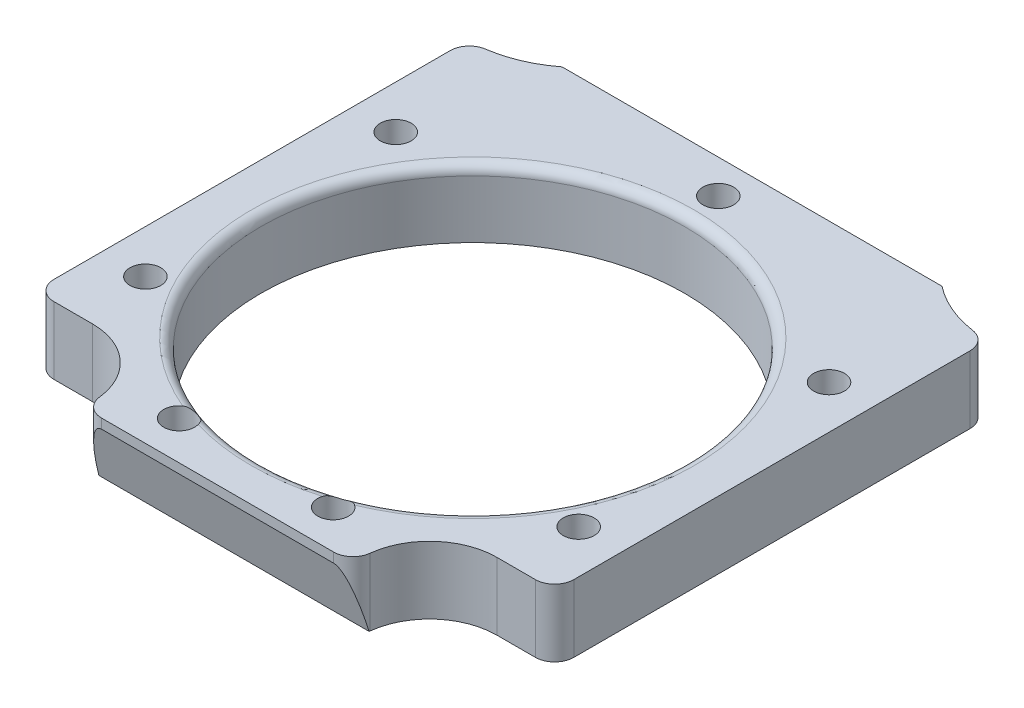
ISO-10303-21;
HEADER;
FILE_DESCRIPTION(('STEP AP214'),'2;1');
FILE_NAME('part.step','',(''),(''),'','','');
FILE_SCHEMA(('AUTOMOTIVE_DESIGN { 1 0 10303 214 1 1 1 1 }'));
ENDSEC;
DATA;
#1=APPLICATION_CONTEXT('core data for automotive mechanical design processes');
#2=APPLICATION_PROTOCOL_DEFINITION('international standard','automotive_design',2000,#1);
#3=PRODUCT_CONTEXT('',#1,'mechanical');
#4=PRODUCT('Part','Part','',(#3));
#5=PRODUCT_RELATED_PRODUCT_CATEGORY('part','',(#4));
#6=PRODUCT_DEFINITION_FORMATION('','',#4);
#7=PRODUCT_DEFINITION_CONTEXT('part definition',#1,'design');
#8=PRODUCT_DEFINITION('design','',#6,#7);
#9=PRODUCT_DEFINITION_SHAPE('','',#8);
#10=(LENGTH_UNIT() NAMED_UNIT(*) SI_UNIT(.MILLI.,.METRE.));
#11=(NAMED_UNIT(*) PLANE_ANGLE_UNIT() SI_UNIT($,.RADIAN.));
#12=(NAMED_UNIT(*) SI_UNIT($,.STERADIAN.) SOLID_ANGLE_UNIT());
#13=UNCERTAINTY_MEASURE_WITH_UNIT(LENGTH_MEASURE(1.E-05),#10,'distance_accuracy_value','');
#14=(GEOMETRIC_REPRESENTATION_CONTEXT(3) GLOBAL_UNCERTAINTY_ASSIGNED_CONTEXT((#13)) GLOBAL_UNIT_ASSIGNED_CONTEXT((#10,
#11,#12)) REPRESENTATION_CONTEXT('',''));
#15=CARTESIAN_POINT('',(0.,0.,0.));
#16=DIRECTION('',(0.,0.,1.));
#17=DIRECTION('',(1.,0.,0.));
#18=AXIS2_PLACEMENT_3D('',#15,#16,#17);
#19=CARTESIAN_POINT('',(-5.,-10.,60.));
#20=DIRECTION('',(0.,1.,0.));
#21=DIRECTION('',(0.,0.,1.));
#22=AXIS2_PLACEMENT_3D('',#19,#20,#21);
#23=CYLINDRICAL_SURFACE('',#22,7.);
#24=CARTESIAN_POINT('',(-5.,-5.,60.));
#25=DIRECTION('',(0.,1.,0.));
#26=DIRECTION('',(0.,0.,-1.));
#27=AXIS2_PLACEMENT_3D('',#24,#25,#26);
#28=CIRCLE('',#27,7.);
#29=CARTESIAN_POINT('',(1.95665592999934,-5.,59.2222222222222));
#30=VERTEX_POINT('',#29);
#31=CARTESIAN_POINT('',(-5.,-5.,53.));
#32=VERTEX_POINT('',#31);
#33=EDGE_CURVE('E338',#30,#32,#28,.T.);
#34=ORIENTED_EDGE('',*,*,#33,.T.);
#35=DIRECTION('',(0.,1.,0.));
#36=VECTOR('',#35,1.);
#37=CARTESIAN_POINT('',(-5.,-10.,53.));
#38=LINE('',#37,#36);
#39=CARTESIAN_POINT('',(-5.,-12.,53.));
#40=VERTEX_POINT('',#39);
#41=EDGE_CURVE('E228',#40,#32,#38,.T.);
#42=ORIENTED_EDGE('',*,*,#41,.F.);
#43=CARTESIAN_POINT('',(-5.,-12.,60.));
#44=DIRECTION('',(0.,1.,0.));
#45=DIRECTION('',(0.,0.,-1.));
#46=AXIS2_PLACEMENT_3D('',#43,#44,#45);
#47=CIRCLE('',#46,7.);
#48=CARTESIAN_POINT('',(1.95665592999934,-12.,59.2222222222222));
#49=VERTEX_POINT('',#48);
#50=EDGE_CURVE('E399',#49,#40,#47,.T.);
#51=ORIENTED_EDGE('',*,*,#50,.F.);
#52=DIRECTION('',(0.,1.,0.));
#53=VECTOR('',#52,1.);
#54=CARTESIAN_POINT('',(1.95665592999934,-10.,59.2222222222222));
#55=LINE('',#54,#53);
#56=EDGE_CURVE('E184',#49,#30,#55,.T.);
#57=ORIENTED_EDGE('',*,*,#56,.T.);
#58=EDGE_LOOP('',(#34,#42,#51,#57));
#59=FACE_BOUND('',#58,.T.);
#60=ADVANCED_FACE('F34',(#59),#23,.F.);
#61=CARTESIAN_POINT('',(-5.,-10.,53.));
#62=DIRECTION('',(0.,0.,-1.));
#63=DIRECTION('',(-1.,0.,0.));
#64=AXIS2_PLACEMENT_3D('',#61,#62,#63);
#65=PLANE('',#64);
#66=DIRECTION('',(-1.,0.,0.));
#67=VECTOR('',#66,1.);
#68=CARTESIAN_POINT('',(-5.,-5.,53.));
#69=LINE('',#68,#67);
#70=CARTESIAN_POINT('',(-9.,-5.,53.));
#71=VERTEX_POINT('',#70);
#72=EDGE_CURVE('E342',#32,#71,#69,.T.);
#73=ORIENTED_EDGE('',*,*,#72,.T.);
#74=DIRECTION('',(0.,1.,0.));
#75=VECTOR('',#74,1.);
#76=CARTESIAN_POINT('',(-9.,-10.,53.));
#77=LINE('',#76,#75);
#78=CARTESIAN_POINT('',(-9.,-12.,53.));
#79=VERTEX_POINT('',#78);
#80=EDGE_CURVE('E225',#79,#71,#77,.T.);
#81=ORIENTED_EDGE('',*,*,#80,.F.);
#82=DIRECTION('',(-1.,0.,0.));
#83=VECTOR('',#82,1.);
#84=CARTESIAN_POINT('',(-5.,-12.,53.));
#85=LINE('',#84,#83);
#86=EDGE_CURVE('E401',#40,#79,#85,.T.);
#87=ORIENTED_EDGE('',*,*,#86,.F.);
#88=ORIENTED_EDGE('',*,*,#41,.T.);
#89=EDGE_LOOP('',(#73,#81,#87,#88));
#90=FACE_BOUND('',#89,.T.);
#91=ADVANCED_FACE('F328',(#90),#65,.F.);
#92=CARTESIAN_POINT('',(-9.,-10.,51.));
#93=DIRECTION('',(0.,1.,0.));
#94=DIRECTION('',(0.,0.,1.));
#95=AXIS2_PLACEMENT_3D('',#92,#93,#94);
#96=CYLINDRICAL_SURFACE('',#95,2.);
#97=CARTESIAN_POINT('',(-9.,-5.,51.));
#98=DIRECTION('',(0.,-1.,0.));
#99=DIRECTION('',(0.,0.,-1.));
#100=AXIS2_PLACEMENT_3D('',#97,#98,#99);
#101=CIRCLE('',#100,2.);
#102=CARTESIAN_POINT('',(-11.,-5.,51.));
#103=VERTEX_POINT('',#102);
#104=EDGE_CURVE('E345',#71,#103,#101,.T.);
#105=ORIENTED_EDGE('',*,*,#104,.T.);
#106=DIRECTION('',(0.,1.,0.));
#107=VECTOR('',#106,1.);
#108=CARTESIAN_POINT('',(-11.,-10.,51.));
#109=LINE('',#108,#107);
#110=CARTESIAN_POINT('',(-11.,-12.,51.));
#111=VERTEX_POINT('',#110);
#112=EDGE_CURVE('E222',#111,#103,#109,.T.);
#113=ORIENTED_EDGE('',*,*,#112,.F.);
#114=CARTESIAN_POINT('',(-9.,-12.,51.));
#115=DIRECTION('',(0.,-1.,0.));
#116=DIRECTION('',(0.,0.,-1.));
#117=AXIS2_PLACEMENT_3D('',#114,#115,#116);
#118=CIRCLE('',#117,2.);
#119=EDGE_CURVE('E404',#79,#111,#118,.T.);
#120=ORIENTED_EDGE('',*,*,#119,.F.);
#121=ORIENTED_EDGE('',*,*,#80,.T.);
#122=EDGE_LOOP('',(#105,#113,#120,#121));
#123=FACE_BOUND('',#122,.T.);
#124=ADVANCED_FACE('F324',(#123),#96,.T.);
#125=CARTESIAN_POINT('',(-11.,-10.,51.));
#126=DIRECTION('',(1.,0.,0.));
#127=DIRECTION('',(0.,0.,-1.));
#128=AXIS2_PLACEMENT_3D('',#125,#126,#127);
#129=PLANE('',#128);
#130=DIRECTION('',(0.,0.,-1.));
#131=VECTOR('',#130,1.);
#132=CARTESIAN_POINT('',(-11.,-5.,51.));
#133=LINE('',#132,#131);
#134=CARTESIAN_POINT('',(-11.,-5.,9.85448097271524));
#135=VERTEX_POINT('',#134);
#136=EDGE_CURVE('E353',#103,#135,#133,.T.);
#137=ORIENTED_EDGE('',*,*,#136,.T.);
#138=DIRECTION('',(0.,1.,0.));
#139=VECTOR('',#138,1.);
#140=CARTESIAN_POINT('',(-11.,-10.,9.85448097271524));
#141=LINE('',#140,#139);
#142=CARTESIAN_POINT('',(-11.,-12.,9.85448097271524));
#143=VERTEX_POINT('',#142);
#144=EDGE_CURVE('E219',#143,#135,#141,.T.);
#145=ORIENTED_EDGE('',*,*,#144,.F.);
#146=DIRECTION('',(0.,0.,-1.));
#147=VECTOR('',#146,1.);
#148=CARTESIAN_POINT('',(-11.,-12.,51.));
#149=LINE('',#148,#147);
#150=EDGE_CURVE('E407',#111,#143,#149,.T.);
#151=ORIENTED_EDGE('',*,*,#150,.F.);
#152=ORIENTED_EDGE('',*,*,#112,.T.);
#153=EDGE_LOOP('',(#137,#145,#151,#152));
#154=FACE_BOUND('',#153,.T.);
#155=ADVANCED_FACE('F320',(#154),#129,.F.);
#156=CARTESIAN_POINT('',(-9.,-10.,9.85448097271524));
#157=DIRECTION('',(0.,1.,0.));
#158=DIRECTION('',(0.,0.,1.));
#159=AXIS2_PLACEMENT_3D('',#156,#157,#158);
#160=CYLINDRICAL_SURFACE('',#159,2.);
#161=CARTESIAN_POINT('',(-9.,-5.,9.85448097271524));
#162=DIRECTION('',(0.,-1.,0.));
#163=DIRECTION('',(0.,0.,-1.));
#164=AXIS2_PLACEMENT_3D('',#161,#162,#163);
#165=CIRCLE('',#164,2.);
#166=CARTESIAN_POINT('',(-9.28950542822678,-5.,7.87554524686985));
#167=VERTEX_POINT('',#166);
#168=EDGE_CURVE('E355',#135,#167,#165,.T.);
#169=ORIENTED_EDGE('',*,*,#168,.T.);
#170=DIRECTION('',(0.,1.,0.));
#171=VECTOR('',#170,1.);
#172=CARTESIAN_POINT('',(-9.28950542822678,-10.,7.87554524686985));
#173=LINE('',#172,#171);
#174=CARTESIAN_POINT('',(-9.28950542822678,-12.,7.87554524686985));
#175=VERTEX_POINT('',#174);
#176=EDGE_CURVE('E216',#175,#167,#173,.T.);
#177=ORIENTED_EDGE('',*,*,#176,.F.);
#178=CARTESIAN_POINT('',(-9.,-12.,9.85448097271524));
#179=DIRECTION('',(0.,-1.,0.));
#180=DIRECTION('',(0.,0.,-1.));
#181=AXIS2_PLACEMENT_3D('',#178,#179,#180);
#182=CIRCLE('',#181,2.);
#183=EDGE_CURVE('E410',#143,#175,#182,.T.);
#184=ORIENTED_EDGE('',*,*,#183,.F.);
#185=ORIENTED_EDGE('',*,*,#144,.T.);
#186=EDGE_LOOP('',(#169,#177,#184,#185));
#187=FACE_BOUND('',#186,.T.);
#188=ADVANCED_FACE('F316',(#187),#160,.T.);
#189=CARTESIAN_POINT('',(-11.,-10.,-3.81666666666667));
#190=DIRECTION('',(0.,1.,0.));
#191=DIRECTION('',(0.,0.,1.));
#192=AXIS2_PLACEMENT_3D('',#189,#190,#191);
#193=CYLINDRICAL_SURFACE('',#192,11.8166666666667);
#194=CARTESIAN_POINT('',(-11.,-5.,-3.81666666666667));
#195=DIRECTION('',(0.,1.,0.));
#196=DIRECTION('',(0.,0.,-1.));
#197=AXIS2_PLACEMENT_3D('',#194,#195,#196);
#198=CIRCLE('',#197,11.8166666666667);
#199=CARTESIAN_POINT('',(-3.73134583754782,-5.,5.49999999999999));
#200=VERTEX_POINT('',#199);
#201=EDGE_CURVE('E357',#167,#200,#198,.T.);
#202=ORIENTED_EDGE('',*,*,#201,.T.);
#203=DIRECTION('',(0.,1.,0.));
#204=VECTOR('',#203,1.);
#205=CARTESIAN_POINT('',(-3.73134583754782,-10.,5.49999999999999));
#206=LINE('',#205,#204);
#207=CARTESIAN_POINT('',(-3.73134583754782,-12.,5.49999999999999));
#208=VERTEX_POINT('',#207);
#209=EDGE_CURVE('E213',#208,#200,#206,.T.);
#210=ORIENTED_EDGE('',*,*,#209,.F.);
#211=CARTESIAN_POINT('',(-11.,-12.,-3.81666666666667));
#212=DIRECTION('',(0.,1.,0.));
#213=DIRECTION('',(0.,0.,-1.));
#214=AXIS2_PLACEMENT_3D('',#211,#212,#213);
#215=CIRCLE('',#214,11.8166666666667);
#216=EDGE_CURVE('E454',#175,#208,#215,.T.);
#217=ORIENTED_EDGE('',*,*,#216,.F.);
#218=ORIENTED_EDGE('',*,*,#176,.T.);
#219=EDGE_LOOP('',(#202,#210,#217,#218));
#220=FACE_BOUND('',#219,.T.);
#221=ADVANCED_FACE('F312',(#220),#193,.F.);
#222=CARTESIAN_POINT('',(-3.73134583754782,-10.,5.49999999999999));
#223=DIRECTION('',(0.,0.,1.));
#224=DIRECTION('',(1.,0.,0.));
#225=AXIS2_PLACEMENT_3D('',#222,#223,#224);
#226=PLANE('',#225);
#227=DIRECTION('',(1.,0.,0.));
#228=VECTOR('',#227,1.);
#229=CARTESIAN_POINT('',(-3.73134583754782,-5.,5.49999999999999));
#230=LINE('',#229,#228);
#231=CARTESIAN_POINT('',(35.7313458375478,-5.,5.5));
#232=VERTEX_POINT('',#231);
#233=EDGE_CURVE('E359',#200,#232,#230,.T.);
#234=ORIENTED_EDGE('',*,*,#233,.T.);
#235=DIRECTION('',(0.,1.,0.));
#236=VECTOR('',#235,1.);
#237=CARTESIAN_POINT('',(35.7313458375478,-10.,5.5));
#238=LINE('',#237,#236);
#239=CARTESIAN_POINT('',(35.7313458375478,-12.,5.5));
#240=VERTEX_POINT('',#239);
#241=EDGE_CURVE('E210',#240,#232,#238,.T.);
#242=ORIENTED_EDGE('',*,*,#241,.F.);
#243=DIRECTION('',(1.,0.,0.));
#244=VECTOR('',#243,1.);
#245=CARTESIAN_POINT('',(-3.73134583754782,-12.,5.49999999999999));
#246=LINE('',#245,#244);
#247=EDGE_CURVE('E457',#208,#240,#246,.T.);
#248=ORIENTED_EDGE('',*,*,#247,.F.);
#249=ORIENTED_EDGE('',*,*,#209,.T.);
#250=EDGE_LOOP('',(#234,#242,#248,#249));
#251=FACE_BOUND('',#250,.T.);
#252=ADVANCED_FACE('F308',(#251),#226,.F.);
#253=CARTESIAN_POINT('',(43.,-10.,-3.81666666666666));
#254=DIRECTION('',(0.,1.,0.));
#255=DIRECTION('',(0.,0.,1.));
#256=AXIS2_PLACEMENT_3D('',#253,#254,#255);
#257=CYLINDRICAL_SURFACE('',#256,11.8166666666667);
#258=CARTESIAN_POINT('',(43.,-5.,-3.81666666666666));
#259=DIRECTION('',(0.,1.,0.));
#260=DIRECTION('',(0.,0.,-1.));
#261=AXIS2_PLACEMENT_3D('',#258,#259,#260);
#262=CIRCLE('',#261,11.8166666666667);
#263=CARTESIAN_POINT('',(41.2895054282268,-5.,7.87554524686987));
#264=VERTEX_POINT('',#263);
#265=EDGE_CURVE('E361',#232,#264,#262,.T.);
#266=ORIENTED_EDGE('',*,*,#265,.T.);
#267=DIRECTION('',(0.,1.,0.));
#268=VECTOR('',#267,1.);
#269=CARTESIAN_POINT('',(41.2895054282268,-10.,7.87554524686987));
#270=LINE('',#269,#268);
#271=CARTESIAN_POINT('',(41.2895054282268,-12.,7.87554524686987));
#272=VERTEX_POINT('',#271);
#273=EDGE_CURVE('E207',#272,#264,#270,.T.);
#274=ORIENTED_EDGE('',*,*,#273,.F.);
#275=CARTESIAN_POINT('',(43.,-12.,-3.81666666666666));
#276=DIRECTION('',(0.,1.,0.));
#277=DIRECTION('',(0.,0.,-1.));
#278=AXIS2_PLACEMENT_3D('',#275,#276,#277);
#279=CIRCLE('',#278,11.8166666666667);
#280=EDGE_CURVE('E460',#240,#272,#279,.T.);
#281=ORIENTED_EDGE('',*,*,#280,.F.);
#282=ORIENTED_EDGE('',*,*,#241,.T.);
#283=EDGE_LOOP('',(#266,#274,#281,#282));
#284=FACE_BOUND('',#283,.T.);
#285=ADVANCED_FACE('F304',(#284),#257,.F.);
#286=CARTESIAN_POINT('',(41.,-10.,9.85448097271526));
#287=DIRECTION('',(0.,1.,0.));
#288=DIRECTION('',(0.,0.,1.));
#289=AXIS2_PLACEMENT_3D('',#286,#287,#288);
#290=CYLINDRICAL_SURFACE('',#289,2.);
#291=CARTESIAN_POINT('',(41.,-5.,9.85448097271526));
#292=DIRECTION('',(0.,-1.,0.));
#293=DIRECTION('',(0.,0.,-1.));
#294=AXIS2_PLACEMENT_3D('',#291,#292,#293);
#295=CIRCLE('',#294,2.);
#296=CARTESIAN_POINT('',(43.,-5.,9.85448097271528));
#297=VERTEX_POINT('',#296);
#298=EDGE_CURVE('E363',#264,#297,#295,.T.);
#299=ORIENTED_EDGE('',*,*,#298,.T.);
#300=DIRECTION('',(0.,1.,0.));
#301=VECTOR('',#300,1.);
#302=CARTESIAN_POINT('',(43.,-10.,9.85448097271528));
#303=LINE('',#302,#301);
#304=CARTESIAN_POINT('',(43.,-12.,9.85448097271528));
#305=VERTEX_POINT('',#304);
#306=EDGE_CURVE('E204',#305,#297,#303,.T.);
#307=ORIENTED_EDGE('',*,*,#306,.F.);
#308=CARTESIAN_POINT('',(41.,-12.,9.85448097271526));
#309=DIRECTION('',(0.,-1.,0.));
#310=DIRECTION('',(0.,0.,-1.));
#311=AXIS2_PLACEMENT_3D('',#308,#309,#310);
#312=CIRCLE('',#311,2.);
#313=EDGE_CURVE('E463',#272,#305,#312,.T.);
#314=ORIENTED_EDGE('',*,*,#313,.F.);
#315=ORIENTED_EDGE('',*,*,#273,.T.);
#316=EDGE_LOOP('',(#299,#307,#314,#315));
#317=FACE_BOUND('',#316,.T.);
#318=ADVANCED_FACE('F300',(#317),#290,.T.);
#319=CARTESIAN_POINT('',(43.,-10.,9.85448097271528));
#320=DIRECTION('',(-1.,0.,0.));
#321=DIRECTION('',(0.,0.,1.));
#322=AXIS2_PLACEMENT_3D('',#319,#320,#321);
#323=PLANE('',#322);
#324=DIRECTION('',(0.,0.,1.));
#325=VECTOR('',#324,1.);
#326=CARTESIAN_POINT('',(43.,-5.,9.85448097271528));
#327=LINE('',#326,#325);
#328=CARTESIAN_POINT('',(43.,-5.,51.));
#329=VERTEX_POINT('',#328);
#330=EDGE_CURVE('E365',#297,#329,#327,.T.);
#331=ORIENTED_EDGE('',*,*,#330,.T.);
#332=DIRECTION('',(0.,1.,0.));
#333=VECTOR('',#332,1.);
#334=CARTESIAN_POINT('',(43.,-10.,51.));
#335=LINE('',#334,#333);
#336=CARTESIAN_POINT('',(43.,-12.,51.));
#337=VERTEX_POINT('',#336);
#338=EDGE_CURVE('E201',#337,#329,#335,.T.);
#339=ORIENTED_EDGE('',*,*,#338,.F.);
#340=DIRECTION('',(0.,0.,1.));
#341=VECTOR('',#340,1.);
#342=CARTESIAN_POINT('',(43.,-12.,9.85448097271528));
#343=LINE('',#342,#341);
#344=EDGE_CURVE('E466',#305,#337,#343,.T.);
#345=ORIENTED_EDGE('',*,*,#344,.F.);
#346=ORIENTED_EDGE('',*,*,#306,.T.);
#347=EDGE_LOOP('',(#331,#339,#345,#346));
#348=FACE_BOUND('',#347,.T.);
#349=ADVANCED_FACE('F296',(#348),#323,.F.);
#350=CARTESIAN_POINT('',(41.,-10.,51.));
#351=DIRECTION('',(0.,1.,0.));
#352=DIRECTION('',(0.,0.,1.));
#353=AXIS2_PLACEMENT_3D('',#350,#351,#352);
#354=CYLINDRICAL_SURFACE('',#353,2.);
#355=CARTESIAN_POINT('',(41.,-5.,51.));
#356=DIRECTION('',(0.,-1.,0.));
#357=DIRECTION('',(0.,0.,-1.));
#358=AXIS2_PLACEMENT_3D('',#355,#356,#357);
#359=CIRCLE('',#358,2.);
#360=CARTESIAN_POINT('',(41.,-5.,53.));
#361=VERTEX_POINT('',#360);
#362=EDGE_CURVE('E367',#329,#361,#359,.T.);
#363=ORIENTED_EDGE('',*,*,#362,.T.);
#364=DIRECTION('',(0.,1.,0.));
#365=VECTOR('',#364,1.);
#366=CARTESIAN_POINT('',(41.,-10.,53.));
#367=LINE('',#366,#365);
#368=CARTESIAN_POINT('',(41.,-12.,53.));
#369=VERTEX_POINT('',#368);
#370=EDGE_CURVE('E198',#369,#361,#367,.T.);
#371=ORIENTED_EDGE('',*,*,#370,.F.);
#372=CARTESIAN_POINT('',(41.,-12.,51.));
#373=DIRECTION('',(0.,-1.,0.));
#374=DIRECTION('',(0.,0.,-1.));
#375=AXIS2_PLACEMENT_3D('',#372,#373,#374);
#376=CIRCLE('',#375,2.);
#377=EDGE_CURVE('E394',#337,#369,#376,.T.);
#378=ORIENTED_EDGE('',*,*,#377,.F.);
#379=ORIENTED_EDGE('',*,*,#338,.T.);
#380=EDGE_LOOP('',(#363,#371,#378,#379));
#381=FACE_BOUND('',#380,.T.);
#382=ADVANCED_FACE('F292',(#381),#354,.T.);
#383=CARTESIAN_POINT('',(41.,-10.,53.));
#384=DIRECTION('',(0.,0.,-1.));
#385=DIRECTION('',(-1.,0.,0.));
#386=AXIS2_PLACEMENT_3D('',#383,#384,#385);
#387=PLANE('',#386);
#388=DIRECTION('',(-1.,0.,0.));
#389=VECTOR('',#388,1.);
#390=CARTESIAN_POINT('',(41.,-5.,53.));
#391=LINE('',#390,#389);
#392=CARTESIAN_POINT('',(37.,-5.,53.));
#393=VERTEX_POINT('',#392);
#394=EDGE_CURVE('E369',#361,#393,#391,.T.);
#395=ORIENTED_EDGE('',*,*,#394,.T.);
#396=DIRECTION('',(0.,1.,0.));
#397=VECTOR('',#396,1.);
#398=CARTESIAN_POINT('',(37.,-10.,53.));
#399=LINE('',#398,#397);
#400=CARTESIAN_POINT('',(37.,-12.,53.));
#401=VERTEX_POINT('',#400);
#402=EDGE_CURVE('E195',#401,#393,#399,.T.);
#403=ORIENTED_EDGE('',*,*,#402,.F.);
#404=DIRECTION('',(-1.,0.,0.));
#405=VECTOR('',#404,1.);
#406=CARTESIAN_POINT('',(41.,-12.,53.));
#407=LINE('',#406,#405);
#408=EDGE_CURVE('E391',#369,#401,#407,.T.);
#409=ORIENTED_EDGE('',*,*,#408,.F.);
#410=ORIENTED_EDGE('',*,*,#370,.T.);
#411=EDGE_LOOP('',(#395,#403,#409,#410));
#412=FACE_BOUND('',#411,.T.);
#413=ADVANCED_FACE('F288',(#412),#387,.F.);
#414=CARTESIAN_POINT('',(37.,-10.,60.));
#415=DIRECTION('',(0.,1.,0.));
#416=DIRECTION('',(0.,0.,1.));
#417=AXIS2_PLACEMENT_3D('',#414,#415,#416);
#418=CYLINDRICAL_SURFACE('',#417,7.);
#419=CARTESIAN_POINT('',(37.,-5.,60.));
#420=DIRECTION('',(0.,1.,0.));
#421=DIRECTION('',(0.,0.,-1.));
#422=AXIS2_PLACEMENT_3D('',#419,#420,#421);
#423=CIRCLE('',#422,7.);
#424=CARTESIAN_POINT('',(30.0433440700007,-5.,59.2222222222222));
#425=VERTEX_POINT('',#424);
#426=EDGE_CURVE('E371',#393,#425,#423,.T.);
#427=ORIENTED_EDGE('',*,*,#426,.T.);
#428=DIRECTION('',(0.,1.,0.));
#429=VECTOR('',#428,1.);
#430=CARTESIAN_POINT('',(30.0433440700007,-10.,59.2222222222222));
#431=LINE('',#430,#429);
#432=CARTESIAN_POINT('',(30.0433440700007,-12.,59.2222222222222));
#433=VERTEX_POINT('',#432);
#434=EDGE_CURVE('E186',#433,#425,#431,.T.);
#435=ORIENTED_EDGE('',*,*,#434,.F.);
#436=CARTESIAN_POINT('',(37.,-12.,60.));
#437=DIRECTION('',(0.,1.,0.));
#438=DIRECTION('',(0.,0.,-1.));
#439=AXIS2_PLACEMENT_3D('',#436,#437,#438);
#440=CIRCLE('',#439,7.);
#441=EDGE_CURVE('E384',#401,#433,#440,.T.);
#442=ORIENTED_EDGE('',*,*,#441,.F.);
#443=ORIENTED_EDGE('',*,*,#402,.T.);
#444=EDGE_LOOP('',(#427,#435,#442,#443));
#445=FACE_BOUND('',#444,.T.);
#446=ADVANCED_FACE('F284',(#445),#418,.F.);
#447=CARTESIAN_POINT('',(28.0557280900008,-10.,59.));
#448=DIRECTION('',(0.,1.,0.));
#449=DIRECTION('',(0.,0.,1.));
#450=AXIS2_PLACEMENT_3D('',#447,#448,#449);
#451=CYLINDRICAL_SURFACE('',#450,2.);
#452=DIRECTION('',(0.,1.,0.));
#453=VECTOR('',#452,1.);
#454=CARTESIAN_POINT('',(28.0557280900008,-10.,61.));
#455=LINE('',#454,#453);
#456=CARTESIAN_POINT('',(28.0557280900009,-6.,61.));
#457=VERTEX_POINT('',#456);
#458=CARTESIAN_POINT('',(28.0557280900008,-5.,61.));
#459=VERTEX_POINT('',#458);
#460=EDGE_CURVE('E183',#457,#459,#455,.T.);
#461=ORIENTED_EDGE('',*,*,#460,.F.);
#462=CARTESIAN_POINT('',(28.0557280900008,-13.0588235294118,59.));
#463=DIRECTION('',(0.,0.272602572456025,-0.962126726315384));
#464=DIRECTION('',(0.,0.962126726315384,0.272602572456025));
#465=AXIS2_PLACEMENT_3D('',#462,#463,#464);
#466=ELLIPSE('',#465,7.336687918903,2.);
#467=CARTESIAN_POINT('',(30.0331000833294,-12.,59.3));
#468=VERTEX_POINT('',#467);
#469=EDGE_CURVE('E166',#457,#468,#466,.T.);
#470=ORIENTED_EDGE('',*,*,#469,.T.);
#471=CARTESIAN_POINT('',(28.0557280900008,-12.,59.));
#472=DIRECTION('',(0.,-1.,0.));
#473=DIRECTION('',(0.,0.,-1.));
#474=AXIS2_PLACEMENT_3D('',#471,#472,#473);
#475=CIRCLE('',#474,2.);
#476=EDGE_CURVE('E381',#433,#468,#475,.T.);
#477=ORIENTED_EDGE('',*,*,#476,.F.);
#478=ORIENTED_EDGE('',*,*,#434,.T.);
#479=CARTESIAN_POINT('',(28.0557280900008,-5.,59.));
#480=DIRECTION('',(0.,-1.,0.));
#481=DIRECTION('',(0.,0.,-1.));
#482=AXIS2_PLACEMENT_3D('',#479,#480,#481);
#483=CIRCLE('',#482,2.);
#484=EDGE_CURVE('E373',#425,#459,#483,.T.);
#485=ORIENTED_EDGE('',*,*,#484,.T.);
#486=EDGE_LOOP('',(#461,#470,#477,#478,#485));
#487=FACE_BOUND('',#486,.T.);
#488=ADVANCED_FACE('F281',(#487),#451,.T.);
#489=CARTESIAN_POINT('',(28.0557280900008,-10.,61.));
#490=DIRECTION('',(0.,0.,-1.));
#491=DIRECTION('',(-1.,0.,0.));
#492=AXIS2_PLACEMENT_3D('',#489,#490,#491);
#493=PLANE('',#492);
#494=DIRECTION('',(0.,1.,0.));
#495=VECTOR('',#494,1.);
#496=CARTESIAN_POINT('',(3.94427190999916,-10.,61.));
#497=LINE('',#496,#495);
#498=CARTESIAN_POINT('',(3.94427190999916,-6.,61.));
#499=VERTEX_POINT('',#498);
#500=CARTESIAN_POINT('',(3.94427190999916,-5.,61.));
#501=VERTEX_POINT('',#500);
#502=EDGE_CURVE('E174',#499,#501,#497,.T.);
#503=ORIENTED_EDGE('',*,*,#502,.F.);
#504=DIRECTION('',(1.,0.,0.));
#505=VECTOR('',#504,1.);
#506=CARTESIAN_POINT('',(-11.,-6.,61.));
#507=LINE('',#506,#505);
#508=EDGE_CURVE('E163',#499,#457,#507,.T.);
#509=ORIENTED_EDGE('',*,*,#508,.T.);
#510=ORIENTED_EDGE('',*,*,#460,.T.);
#511=DIRECTION('',(-1.,0.,0.));
#512=VECTOR('',#511,1.);
#513=CARTESIAN_POINT('',(28.0557280900008,-5.,61.));
#514=LINE('',#513,#512);
#515=EDGE_CURVE('E181',#459,#501,#514,.T.);
#516=ORIENTED_EDGE('',*,*,#515,.T.);
#517=EDGE_LOOP('',(#503,#509,#510,#516));
#518=FACE_BOUND('',#517,.T.);
#519=ADVANCED_FACE('F179',(#518),#493,.F.);
#520=CARTESIAN_POINT('',(3.94427190999916,-10.,59.));
#521=DIRECTION('',(0.,1.,0.));
#522=DIRECTION('',(0.,0.,1.));
#523=AXIS2_PLACEMENT_3D('',#520,#521,#522);
#524=CYLINDRICAL_SURFACE('',#523,2.);
#525=CARTESIAN_POINT('',(3.94427190999916,-12.,59.));
#526=DIRECTION('',(0.,-1.,0.));
#527=DIRECTION('',(0.,0.,-1.));
#528=AXIS2_PLACEMENT_3D('',#525,#526,#527);
#529=CIRCLE('',#528,2.);
#530=CARTESIAN_POINT('',(1.96689991667064,-12.,59.3));
#531=VERTEX_POINT('',#530);
#532=EDGE_CURVE('E177',#531,#49,#529,.T.);
#533=ORIENTED_EDGE('',*,*,#532,.F.);
#534=CARTESIAN_POINT('',(3.94427190999916,-13.0588235294118,59.));
#535=DIRECTION('',(0.,0.272602572456025,-0.962126726315384));
#536=DIRECTION('',(0.,0.962126726315384,0.272602572456025));
#537=AXIS2_PLACEMENT_3D('',#534,#535,#536);
#538=ELLIPSE('',#537,7.336687918903,2.);
#539=EDGE_CURVE('E49',#531,#499,#538,.T.);
#540=ORIENTED_EDGE('',*,*,#539,.T.);
#541=ORIENTED_EDGE('',*,*,#502,.T.);
#542=CARTESIAN_POINT('',(3.94427190999916,-5.,59.));
#543=DIRECTION('',(0.,-1.,0.));
#544=DIRECTION('',(0.,0.,-1.));
#545=AXIS2_PLACEMENT_3D('',#542,#543,#544);
#546=CIRCLE('',#545,2.);
#547=EDGE_CURVE('E189',#501,#30,#546,.T.);
#548=ORIENTED_EDGE('',*,*,#547,.T.);
#549=ORIENTED_EDGE('',*,*,#56,.F.);
#550=EDGE_LOOP('',(#533,#540,#541,#548,#549));
#551=FACE_BOUND('',#550,.T.);
#552=ADVANCED_FACE('F173',(#551),#524,.T.);
#553=CARTESIAN_POINT('',(-5.,-5.,60.));
#554=DIRECTION('',(0.,-1.,0.));
#555=DIRECTION('',(0.,0.,-1.));
#556=AXIS2_PLACEMENT_3D('',#553,#554,#555);
#557=PLANE('',#556);
#558=CARTESIAN_POINT('',(16.,-5.,9.00000000000001));
#559=DIRECTION('',(0.,-1.,0.));
#560=DIRECTION('',(0.,0.,-1.));
#561=AXIS2_PLACEMENT_3D('',#558,#559,#560);
#562=CIRCLE('',#561,1.6);
#563=CARTESIAN_POINT('',(16.,-5.,7.4));
#564=VERTEX_POINT('',#563);
#565=EDGE_CURVE('E413',#564,#564,#562,.T.);
#566=ORIENTED_EDGE('',*,*,#565,.T.);
#567=EDGE_LOOP('',(#566));
#568=FACE_BOUND('',#567,.T.);
#569=CARTESIAN_POINT('',(8.,-5.,57.));
#570=DIRECTION('',(0.,-1.,0.));
#571=DIRECTION('',(0.,0.,-1.));
#572=AXIS2_PLACEMENT_3D('',#569,#570,#571);
#573=CIRCLE('',#572,1.6);
#574=CARTESIAN_POINT('',(9.54249076188678,-5.,56.5748856042264));
#575=VERTEX_POINT('',#574);
#576=CARTESIAN_POINT('',(7.07211686634647,-5.,55.6965304413676));
#577=VERTEX_POINT('',#576);
#578=EDGE_CURVE('E416',#575,#577,#573,.T.);
#579=ORIENTED_EDGE('',*,*,#578,.T.);
#580=CARTESIAN_POINT('',(16.,-5.,34.5));
#581=DIRECTION('',(0.,-1.,0.));
#582=DIRECTION('',(0.,0.,-1.));
#583=AXIS2_PLACEMENT_3D('',#580,#581,#582);
#584=CIRCLE('',#583,23.);
#585=CARTESIAN_POINT('',(24.9278831336535,-5.,55.6965304413676));
#586=VERTEX_POINT('',#585);
#587=EDGE_CURVE('E233',#577,#586,#584,.T.);
#588=ORIENTED_EDGE('',*,*,#587,.T.);
#589=CARTESIAN_POINT('',(24.,-5.,57.));
#590=DIRECTION('',(0.,-1.,0.));
#591=DIRECTION('',(0.,0.,-1.));
#592=AXIS2_PLACEMENT_3D('',#589,#590,#591);
#593=CIRCLE('',#592,1.6);
#594=CARTESIAN_POINT('',(22.4575092381132,-5.,56.5748856042264));
#595=VERTEX_POINT('',#594);
#596=EDGE_CURVE('E419',#586,#595,#593,.T.);
#597=ORIENTED_EDGE('',*,*,#596,.T.);
#598=CARTESIAN_POINT('',(16.,-5.,34.5));
#599=DIRECTION('',(0.,-1.,0.));
#600=DIRECTION('',(0.,0.,-1.));
#601=AXIS2_PLACEMENT_3D('',#598,#599,#600);
#602=CIRCLE('',#601,23.);
#603=EDGE_CURVE('E231',#595,#575,#602,.T.);
#604=ORIENTED_EDGE('',*,*,#603,.T.);
#605=EDGE_LOOP('',(#579,#588,#597,#604));
#606=FACE_BOUND('',#605,.T.);
#607=CARTESIAN_POINT('',(38.5,-5.,46.));
#608=DIRECTION('',(0.,-1.,0.));
#609=DIRECTION('',(0.,0.,-1.));
#610=AXIS2_PLACEMENT_3D('',#607,#608,#609);
#611=CIRCLE('',#610,1.6);
#612=CARTESIAN_POINT('',(38.5,-5.,44.4));
#613=VERTEX_POINT('',#612);
#614=EDGE_CURVE('E421',#613,#613,#611,.T.);
#615=ORIENTED_EDGE('',*,*,#614,.T.);
#616=EDGE_LOOP('',(#615));
#617=FACE_BOUND('',#616,.T.);
#618=CARTESIAN_POINT('',(-6.5,-5.,46.));
#619=DIRECTION('',(0.,-1.,0.));
#620=DIRECTION('',(0.,0.,-1.));
#621=AXIS2_PLACEMENT_3D('',#618,#619,#620);
#622=CIRCLE('',#621,1.59999999999999);
#623=CARTESIAN_POINT('',(-6.5,-5.,44.4));
#624=VERTEX_POINT('',#623);
#625=EDGE_CURVE('E424',#624,#624,#622,.T.);
#626=ORIENTED_EDGE('',*,*,#625,.T.);
#627=EDGE_LOOP('',(#626));
#628=FACE_BOUND('',#627,.T.);
#629=CARTESIAN_POINT('',(-6.5,-5.,20.));
#630=DIRECTION('',(0.,-1.,0.));
#631=DIRECTION('',(0.,0.,-1.));
#632=AXIS2_PLACEMENT_3D('',#629,#630,#631);
#633=CIRCLE('',#632,1.6);
#634=CARTESIAN_POINT('',(-6.5,-5.,18.4));
#635=VERTEX_POINT('',#634);
#636=EDGE_CURVE('E348',#635,#635,#633,.T.);
#637=ORIENTED_EDGE('',*,*,#636,.T.);
#638=EDGE_LOOP('',(#637));
#639=FACE_BOUND('',#638,.T.);
#640=CARTESIAN_POINT('',(38.5,-5.,20.));
#641=DIRECTION('',(0.,-1.,0.));
#642=DIRECTION('',(0.,0.,-1.));
#643=AXIS2_PLACEMENT_3D('',#640,#641,#642);
#644=CIRCLE('',#643,1.6);
#645=CARTESIAN_POINT('',(38.5,-5.,18.4));
#646=VERTEX_POINT('',#645);
#647=EDGE_CURVE('E343',#646,#646,#644,.T.);
#648=ORIENTED_EDGE('',*,*,#647,.T.);
#649=EDGE_LOOP('',(#648));
#650=FACE_BOUND('',#649,.T.);
#651=ORIENTED_EDGE('',*,*,#33,.F.);
#652=ORIENTED_EDGE('',*,*,#547,.F.);
#653=ORIENTED_EDGE('',*,*,#515,.F.);
#654=ORIENTED_EDGE('',*,*,#484,.F.);
#655=ORIENTED_EDGE('',*,*,#426,.F.);
#656=ORIENTED_EDGE('',*,*,#394,.F.);
#657=ORIENTED_EDGE('',*,*,#362,.F.);
#658=ORIENTED_EDGE('',*,*,#330,.F.);
#659=ORIENTED_EDGE('',*,*,#298,.F.);
#660=ORIENTED_EDGE('',*,*,#265,.F.);
#661=ORIENTED_EDGE('',*,*,#233,.F.);
#662=ORIENTED_EDGE('',*,*,#201,.F.);
#663=ORIENTED_EDGE('',*,*,#168,.F.);
#664=ORIENTED_EDGE('',*,*,#136,.F.);
#665=ORIENTED_EDGE('',*,*,#104,.F.);
#666=ORIENTED_EDGE('',*,*,#72,.F.);
#667=EDGE_LOOP('',(#651,#652,#653,#654,#655,#656,#657,#658,#659,#660,#661,#662,#663,#664,#665,#666));
#668=FACE_BOUND('',#667,.T.);
#669=ADVANCED_FACE('F272',(#568,#606,#617,#628,#639,#650,#668),#557,.F.);
#670=CARTESIAN_POINT('',(16.,-5.,34.5));
#671=DIRECTION('',(0.,-1.,0.));
#672=DIRECTION('',(0.,0.,-1.));
#673=AXIS2_PLACEMENT_3D('',#670,#671,#672);
#674=CYLINDRICAL_SURFACE('',#673,22.);
#675=CARTESIAN_POINT('',(16.,-6.,34.5));
#676=DIRECTION('',(0.,-1.,0.));
#677=DIRECTION('',(0.,0.,-1.));
#678=AXIS2_PLACEMENT_3D('',#675,#676,#677);
#679=CIRCLE('',#678,22.);
#680=CARTESIAN_POINT('',(16.,-6.,12.5));
#681=VERTEX_POINT('',#680);
#682=EDGE_CURVE('E43',#681,#681,#679,.F.);
#683=ORIENTED_EDGE('',*,*,#682,.T.);
#684=EDGE_LOOP('',(#683));
#685=FACE_BOUND('',#684,.T.);
#686=CARTESIAN_POINT('',(16.,-12.,34.5));
#687=DIRECTION('',(0.,-1.,0.));
#688=DIRECTION('',(0.,0.,-1.));
#689=AXIS2_PLACEMENT_3D('',#686,#687,#688);
#690=CIRCLE('',#689,22.);
#691=CARTESIAN_POINT('',(16.,-12.,12.5));
#692=VERTEX_POINT('',#691);
#693=EDGE_CURVE('E487',#692,#692,#690,.T.);
#694=ORIENTED_EDGE('',*,*,#693,.T.);
#695=EDGE_LOOP('',(#694));
#696=FACE_BOUND('',#695,.T.);
#697=ADVANCED_FACE('F268',(#685,#696),#674,.F.);
#698=CARTESIAN_POINT('',(38.5,-5.,20.));
#699=DIRECTION('',(0.,-1.,0.));
#700=DIRECTION('',(0.,0.,-1.));
#701=AXIS2_PLACEMENT_3D('',#698,#699,#700);
#702=CYLINDRICAL_SURFACE('',#701,1.6);
#703=ORIENTED_EDGE('',*,*,#647,.F.);
#704=EDGE_LOOP('',(#703));
#705=FACE_BOUND('',#704,.T.);
#706=CARTESIAN_POINT('',(38.5,-12.,20.));
#707=DIRECTION('',(0.,-1.,0.));
#708=DIRECTION('',(0.,0.,-1.));
#709=AXIS2_PLACEMENT_3D('',#706,#707,#708);
#710=CIRCLE('',#709,1.6);
#711=CARTESIAN_POINT('',(38.5,-12.,18.4));
#712=VERTEX_POINT('',#711);
#713=EDGE_CURVE('E435',#712,#712,#710,.T.);
#714=ORIENTED_EDGE('',*,*,#713,.T.);
#715=EDGE_LOOP('',(#714));
#716=FACE_BOUND('',#715,.T.);
#717=ADVANCED_FACE('F264',(#705,#716),#702,.F.);
#718=CARTESIAN_POINT('',(-6.5,-5.,20.));
#719=DIRECTION('',(0.,-1.,0.));
#720=DIRECTION('',(0.,0.,-1.));
#721=AXIS2_PLACEMENT_3D('',#718,#719,#720);
#722=CYLINDRICAL_SURFACE('',#721,1.6);
#723=ORIENTED_EDGE('',*,*,#636,.F.);
#724=EDGE_LOOP('',(#723));
#725=FACE_BOUND('',#724,.T.);
#726=CARTESIAN_POINT('',(-6.5,-12.,20.));
#727=DIRECTION('',(0.,-1.,0.));
#728=DIRECTION('',(0.,0.,-1.));
#729=AXIS2_PLACEMENT_3D('',#726,#727,#728);
#730=CIRCLE('',#729,1.6);
#731=CARTESIAN_POINT('',(-6.5,-12.,18.4));
#732=VERTEX_POINT('',#731);
#733=EDGE_CURVE('E433',#732,#732,#730,.T.);
#734=ORIENTED_EDGE('',*,*,#733,.T.);
#735=EDGE_LOOP('',(#734));
#736=FACE_BOUND('',#735,.T.);
#737=ADVANCED_FACE('F260',(#725,#736),#722,.F.);
#738=CARTESIAN_POINT('',(-6.5,-5.,46.));
#739=DIRECTION('',(0.,-1.,0.));
#740=DIRECTION('',(0.,0.,-1.));
#741=AXIS2_PLACEMENT_3D('',#738,#739,#740);
#742=CYLINDRICAL_SURFACE('',#741,1.59999999999999);
#743=ORIENTED_EDGE('',*,*,#625,.F.);
#744=EDGE_LOOP('',(#743));
#745=FACE_BOUND('',#744,.T.);
#746=CARTESIAN_POINT('',(-6.5,-12.,46.));
#747=DIRECTION('',(0.,-1.,0.));
#748=DIRECTION('',(0.,0.,-1.));
#749=AXIS2_PLACEMENT_3D('',#746,#747,#748);
#750=CIRCLE('',#749,1.59999999999999);
#751=CARTESIAN_POINT('',(-6.5,-12.,44.4));
#752=VERTEX_POINT('',#751);
#753=EDGE_CURVE('E436',#752,#752,#750,.T.);
#754=ORIENTED_EDGE('',*,*,#753,.T.);
#755=EDGE_LOOP('',(#754));
#756=FACE_BOUND('',#755,.T.);
#757=ADVANCED_FACE('F256',(#745,#756),#742,.F.);
#758=CARTESIAN_POINT('',(38.5,-5.,46.));
#759=DIRECTION('',(0.,-1.,0.));
#760=DIRECTION('',(0.,0.,-1.));
#761=AXIS2_PLACEMENT_3D('',#758,#759,#760);
#762=CYLINDRICAL_SURFACE('',#761,1.6);
#763=ORIENTED_EDGE('',*,*,#614,.F.);
#764=EDGE_LOOP('',(#763));
#765=FACE_BOUND('',#764,.T.);
#766=CARTESIAN_POINT('',(38.5,-12.,46.));
#767=DIRECTION('',(0.,-1.,0.));
#768=DIRECTION('',(0.,0.,-1.));
#769=AXIS2_PLACEMENT_3D('',#766,#767,#768);
#770=CIRCLE('',#769,1.6);
#771=CARTESIAN_POINT('',(38.5,-12.,44.4));
#772=VERTEX_POINT('',#771);
#773=EDGE_CURVE('E448',#772,#772,#770,.T.);
#774=ORIENTED_EDGE('',*,*,#773,.T.);
#775=EDGE_LOOP('',(#774));
#776=FACE_BOUND('',#775,.T.);
#777=ADVANCED_FACE('F251',(#765,#776),#762,.F.);
#778=CARTESIAN_POINT('',(24.,-5.,57.));
#779=DIRECTION('',(0.,-1.,0.));
#780=DIRECTION('',(0.,0.,-1.));
#781=AXIS2_PLACEMENT_3D('',#778,#779,#780);
#782=CYLINDRICAL_SURFACE('',#781,1.6);
#783=ORIENTED_EDGE('',*,*,#596,.F.);
#784=CARTESIAN_POINT('',(24.9278831336535,-5.,55.6965304413676));
#785=CARTESIAN_POINT('',(24.8985595586239,-4.99999916298257,55.6756495852396));
#786=CARTESIAN_POINT('',(24.8685585951859,-5.00140627967512,55.6557914407111));
#787=CARTESIAN_POINT('',(24.8075025524096,-5.00664543457321,55.6182556891589));
#788=CARTESIAN_POINT('',(24.7764496754766,-5.01047267080839,55.6005738467524));
#789=CARTESIAN_POINT('',(24.6826260943259,-5.02491105366178,55.5512145377805));
#790=CARTESIAN_POINT('',(24.6185837044822,-5.03849503488442,55.5227949206222));
#791=CARTESIAN_POINT('',(24.4687487862134,-5.07562063169612,55.4675262390698));
#792=CARTESIAN_POINT('',(24.3822782099163,-5.10093550205885,55.4437979635193));
#793=CARTESIAN_POINT('',(24.206978483967,-5.15424385021034,55.4109235326586));
#794=CARTESIAN_POINT('',(24.1181394691739,-5.18225047102885,55.401853224894));
#795=CARTESIAN_POINT('',(23.9585111419398,-5.22845259836079,55.3990050833753));
#796=CARTESIAN_POINT('',(23.8880091573117,-5.24745592054002,55.4023244502546));
#797=CARTESIAN_POINT('',(23.7468238221568,-5.27882226293274,55.4185792090326));
#798=CARTESIAN_POINT('',(23.6761434915796,-5.29122048232235,55.4314627340598));
#799=CARTESIAN_POINT('',(23.5707377221875,-5.30222673232844,55.4582217344557));
#800=CARTESIAN_POINT('',(23.5354597088705,-5.30461969104205,55.4684791227803));
#801=CARTESIAN_POINT('',(23.4656181713576,-5.30658654178749,55.4914296616354));
#802=CARTESIAN_POINT('',(23.431054588409,-5.30616066656456,55.5041226109828));
#803=CARTESIAN_POINT('',(23.3629538722735,-5.30251977427189,55.5318287364844));
#804=CARTESIAN_POINT('',(23.3294187107156,-5.29929970898891,55.5468460716952));
#805=CARTESIAN_POINT('',(23.2637149406072,-5.2903709765539,55.5790058667908));
#806=CARTESIAN_POINT('',(23.2315473034796,-5.28466057176398,55.596149804528));
#807=CARTESIAN_POINT('',(23.1276259944778,-5.26239886056287,55.6561346211445));
#808=CARTESIAN_POINT('',(23.059231390776,-5.24144687965047,55.7032118069989));
#809=CARTESIAN_POINT('',(22.9312276469607,-5.19513863322594,55.8064578023954));
#810=CARTESIAN_POINT('',(22.8716537137377,-5.16976555369506,55.8626612626835));
#811=CARTESIAN_POINT('',(22.7589849379539,-5.11891304658427,55.9864923619498));
#812=CARTESIAN_POINT('',(22.7063092929026,-5.09348150619506,56.0545240103173));
#813=CARTESIAN_POINT('',(22.6120231625273,-5.04926873593281,56.199434752896));
#814=CARTESIAN_POINT('',(22.5703443153537,-5.03044616687419,56.2762547150956));
#815=CARTESIAN_POINT('',(22.5195995748642,-5.01211633237173,56.3918189104083));
#816=CARTESIAN_POINT('',(22.5054057097386,-5.00770366956671,56.4275752387293));
#817=CARTESIAN_POINT('',(22.4795164907979,-5.00163973044508,56.5003678968644));
#818=CARTESIAN_POINT('',(22.4678315564809,-4.99999978258573,56.5374088498234));
#819=CARTESIAN_POINT('',(22.4575092381132,-5.,56.5748856042264));
#820=B_SPLINE_CURVE_WITH_KNOTS('',3,(#784,#785,#786,#787,#788,#789,#790,#791,#792,#793,#794,
#795,#796,#797,#798,#799,#800,#801,#802,#803,#804,#805,#806,#807,#808,#809,#810,#811,#812,#813,
#814,#815,#816,#817,#818,#819),.UNSPECIFIED.,.F.,.F.,(4,2,2,2,2,2,2,2,2,2,2,2,2,2,2,2,2,4),(0.,
0.107881522043801,0.215549655755381,0.428690437755951,0.706817006681653,0.98637818395702,
1.20499262445801,1.42243009072709,1.53270696988103,1.64297474381636,1.75344215233144,
1.8639867632684,2.11937916653092,2.37576494984417,2.64383924129275,2.91020553335893,
3.02619608942619,3.14265941200959),.UNSPECIFIED.);
#821=EDGE_CURVE('E56',#586,#595,#820,.T.);
#822=ORIENTED_EDGE('',*,*,#821,.T.);
#823=EDGE_LOOP('',(#783,#822));
#824=FACE_BOUND('',#823,.T.);
#825=CARTESIAN_POINT('',(24.,-12.,57.));
#826=DIRECTION('',(0.,-1.,0.));
#827=DIRECTION('',(0.,0.,-1.));
#828=AXIS2_PLACEMENT_3D('',#825,#826,#827);
#829=CIRCLE('',#828,1.6);
#830=CARTESIAN_POINT('',(24.,-12.,55.4));
#831=VERTEX_POINT('',#830);
#832=EDGE_CURVE('E439',#831,#831,#829,.T.);
#833=ORIENTED_EDGE('',*,*,#832,.T.);
#834=EDGE_LOOP('',(#833));
#835=FACE_BOUND('',#834,.T.);
#836=ADVANCED_FACE('F246',(#824,#835),#782,.F.);
#837=CARTESIAN_POINT('',(8.,-5.,57.));
#838=DIRECTION('',(0.,-1.,0.));
#839=DIRECTION('',(0.,0.,-1.));
#840=AXIS2_PLACEMENT_3D('',#837,#838,#839);
#841=CYLINDRICAL_SURFACE('',#840,1.6);
#842=ORIENTED_EDGE('',*,*,#578,.F.);
#843=CARTESIAN_POINT('',(9.54249076188678,-5.,56.5748856042264));
#844=CARTESIAN_POINT('',(9.5329313706535,-4.99999916298257,56.5401796934271));
#845=CARTESIAN_POINT('',(9.52220099967551,-5.00140627967511,56.5058392966618));
#846=CARTESIAN_POINT('',(9.49854617396921,-5.00664543457321,56.4381841252047));
#847=CARTESIAN_POINT('',(9.48562610109364,-5.01047267080839,56.4048674561996));
#848=CARTESIAN_POINT('',(9.44402307166097,-5.02491105366178,56.3073564634647));
#849=CARTESIAN_POINT('',(9.41229718874747,-5.03849503488442,56.2448859048817));
#850=CARTESIAN_POINT('',(9.3309858915173,-5.07562063169612,56.107431902263));
#851=CARTESIAN_POINT('',(9.2789044655301,-5.10093550205885,56.0344406925669));
#852=CARTESIAN_POINT('',(9.16370672999097,-5.15424385021034,55.8982782753992));
#853=CARTESIAN_POINT('',(9.10053488694487,-5.18225047102884,55.8351596626252));
#854=CARTESIAN_POINT('',(8.97853524332795,-5.22845259836078,55.7321771314705));
#855=CARTESIAN_POINT('',(8.92176281934143,-5.24745592054001,55.6902433752868));
#856=CARTESIAN_POINT('',(8.80200669898659,-5.27882226293274,55.6137189498836));
#857=CARTESIAN_POINT('',(8.73905808836396,-5.29122048232236,55.5790899624842));
#858=CARTESIAN_POINT('',(8.64041899734039,-5.30222673232845,55.5332996791767));
#859=CARTESIAN_POINT('',(8.60658408074895,-5.30461969104205,55.5189835813116));
#860=CARTESIAN_POINT('',(8.53793065864821,-5.30658654178748,55.4926914678597));
#861=CARTESIAN_POINT('',(8.50311223458147,-5.30616066656456,55.4807152591572));
#862=CARTESIAN_POINT('',(8.43280667229913,-5.30251977427189,55.4592102634436));
#863=CARTESIAN_POINT('',(8.39731843753394,-5.29929970898891,55.4496859466283));
#864=CARTESIAN_POINT('',(8.32606018489934,-5.29037097655389,55.4331481336375));
#865=CARTESIAN_POINT('',(8.29028998743317,-5.28466057176398,55.4261363968525));
#866=CARTESIAN_POINT('',(8.1718266241925,-5.26239886056287,55.4070511077828));
#867=CARTESIAN_POINT('',(8.08906415090063,-5.24144687965047,55.4003835551505));
#868=CARTESIAN_POINT('',(7.92461309602114,-5.19513863322593,55.3996456221222));
#869=CARTESIAN_POINT('',(7.84292994359391,-5.16976555369505,55.4056243408459));
#870=CARTESIAN_POINT('',(7.67737630602053,-5.11891304658427,55.4305319153629));
#871=CARTESIAN_POINT('',(7.59357587211217,-5.09348150619506,55.4500387356559));
#872=CARTESIAN_POINT('',(7.42897103478324,-5.04926873593281,55.5028993563842));
#873=CARTESIAN_POINT('',(7.34815094437655,-5.03044616687419,55.5361641407775));
#874=CARTESIAN_POINT('',(7.23584060365929,-5.01211633237173,55.5937531961056));
#875=CARTESIAN_POINT('',(7.2022596916955,-5.00770366956671,55.612522937017));
#876=CARTESIAN_POINT('',(7.13622748826685,-5.00163973044508,55.6526324227541));
#877=CARTESIAN_POINT('',(7.10378135890793,-4.99999978258573,55.6739823308505));
#878=CARTESIAN_POINT('',(7.07211686634647,-5.,55.6965304413676));
#879=B_SPLINE_CURVE_WITH_KNOTS('',3,(#843,#844,#845,#846,#847,#848,#849,#850,#851,#852,#853,
#854,#855,#856,#857,#858,#859,#860,#861,#862,#863,#864,#865,#866,#867,#868,#869,#870,#871,#872,
#873,#874,#875,#876,#877,#878),.UNSPECIFIED.,.F.,.F.,(4,2,2,2,2,2,2,2,2,2,2,2,2,2,2,2,2,4),(0.,
0.107881522043798,0.215549655755387,0.428690437755953,0.706817006681648,0.986378183957011,
1.204992624458,1.42243009072708,1.53270696988102,1.64297474381635,1.75344215233144,
1.8639867632684,2.11937916653093,2.37576494984417,2.64383924129275,2.91020553335894,
3.0261960894262,3.14265941200958),.UNSPECIFIED.);
#880=EDGE_CURVE('E241',#575,#577,#879,.T.);
#881=ORIENTED_EDGE('',*,*,#880,.T.);
#882=EDGE_LOOP('',(#842,#881));
#883=FACE_BOUND('',#882,.T.);
#884=CARTESIAN_POINT('',(8.,-12.,57.));
#885=DIRECTION('',(0.,-1.,0.));
#886=DIRECTION('',(0.,0.,-1.));
#887=AXIS2_PLACEMENT_3D('',#884,#885,#886);
#888=CIRCLE('',#887,1.6);
#889=CARTESIAN_POINT('',(8.,-12.,55.4));
#890=VERTEX_POINT('',#889);
#891=EDGE_CURVE('E442',#890,#890,#888,.T.);
#892=ORIENTED_EDGE('',*,*,#891,.T.);
#893=EDGE_LOOP('',(#892));
#894=FACE_BOUND('',#893,.T.);
#895=ADVANCED_FACE('F250',(#883,#894),#841,.F.);
#896=CARTESIAN_POINT('',(16.,-5.,9.00000000000001));
#897=DIRECTION('',(0.,-1.,0.));
#898=DIRECTION('',(0.,0.,-1.));
#899=AXIS2_PLACEMENT_3D('',#896,#897,#898);
#900=CYLINDRICAL_SURFACE('',#899,1.6);
#901=ORIENTED_EDGE('',*,*,#565,.F.);
#902=EDGE_LOOP('',(#901));
#903=FACE_BOUND('',#902,.T.);
#904=CARTESIAN_POINT('',(16.,-12.,9.00000000000001));
#905=DIRECTION('',(0.,-1.,0.));
#906=DIRECTION('',(0.,0.,-1.));
#907=AXIS2_PLACEMENT_3D('',#904,#905,#906);
#908=CIRCLE('',#907,1.6);
#909=CARTESIAN_POINT('',(16.,-12.,7.4));
#910=VERTEX_POINT('',#909);
#911=EDGE_CURVE('E451',#910,#910,#908,.T.);
#912=ORIENTED_EDGE('',*,*,#911,.T.);
#913=EDGE_LOOP('',(#912));
#914=FACE_BOUND('',#913,.T.);
#915=ADVANCED_FACE('F495',(#903,#914),#900,.F.);
#916=CARTESIAN_POINT('',(-11.,-12.,-3.81666666666667));
#917=DIRECTION('',(0.,-1.,0.));
#918=DIRECTION('',(0.,0.,-1.));
#919=AXIS2_PLACEMENT_3D('',#916,#917,#918);
#920=PLANE('',#919);
#921=DIRECTION('',(1.,0.,0.));
#922=VECTOR('',#921,1.);
#923=CARTESIAN_POINT('',(-11.,-12.,59.3));
#924=LINE('',#923,#922);
#925=EDGE_CURVE('E11',#531,#468,#924,.T.);
#926=ORIENTED_EDGE('',*,*,#925,.F.);
#927=ORIENTED_EDGE('',*,*,#532,.T.);
#928=ORIENTED_EDGE('',*,*,#50,.T.);
#929=ORIENTED_EDGE('',*,*,#86,.T.);
#930=ORIENTED_EDGE('',*,*,#119,.T.);
#931=ORIENTED_EDGE('',*,*,#150,.T.);
#932=ORIENTED_EDGE('',*,*,#183,.T.);
#933=ORIENTED_EDGE('',*,*,#216,.T.);
#934=ORIENTED_EDGE('',*,*,#247,.T.);
#935=ORIENTED_EDGE('',*,*,#280,.T.);
#936=ORIENTED_EDGE('',*,*,#313,.T.);
#937=ORIENTED_EDGE('',*,*,#344,.T.);
#938=ORIENTED_EDGE('',*,*,#377,.T.);
#939=ORIENTED_EDGE('',*,*,#408,.T.);
#940=ORIENTED_EDGE('',*,*,#441,.T.);
#941=ORIENTED_EDGE('',*,*,#476,.T.);
#942=EDGE_LOOP('',(#926,#927,#928,#929,#930,#931,#932,#933,#934,#935,#936,#937,#938,#939,#940,#941));
#943=FACE_BOUND('',#942,.T.);
#944=ORIENTED_EDGE('',*,*,#891,.F.);
#945=EDGE_LOOP('',(#944));
#946=FACE_BOUND('',#945,.T.);
#947=ORIENTED_EDGE('',*,*,#733,.F.);
#948=EDGE_LOOP('',(#947));
#949=FACE_BOUND('',#948,.T.);
#950=ORIENTED_EDGE('',*,*,#832,.F.);
#951=EDGE_LOOP('',(#950));
#952=FACE_BOUND('',#951,.T.);
#953=ORIENTED_EDGE('',*,*,#911,.F.);
#954=EDGE_LOOP('',(#953));
#955=FACE_BOUND('',#954,.T.);
#956=ORIENTED_EDGE('',*,*,#773,.F.);
#957=EDGE_LOOP('',(#956));
#958=FACE_BOUND('',#957,.T.);
#959=ORIENTED_EDGE('',*,*,#713,.F.);
#960=EDGE_LOOP('',(#959));
#961=FACE_BOUND('',#960,.T.);
#962=ORIENTED_EDGE('',*,*,#753,.F.);
#963=EDGE_LOOP('',(#962));
#964=FACE_BOUND('',#963,.T.);
#965=ORIENTED_EDGE('',*,*,#693,.F.);
#966=EDGE_LOOP('',(#965));
#967=FACE_BOUND('',#966,.T.);
#968=ADVANCED_FACE('F387',(#943,#946,#949,#952,#955,#958,#961,#964,#967),#920,.T.);
#969=CARTESIAN_POINT('',(16.,-6.,34.5));
#970=DIRECTION('',(0.,-1.,0.));
#971=DIRECTION('',(0.,0.,-1.));
#972=AXIS2_PLACEMENT_3D('',#969,#970,#971);
#973=TOROIDAL_SURFACE('',#972,23.,1.);
#974=ORIENTED_EDGE('',*,*,#682,.F.);
#975=EDGE_LOOP('',(#974));
#976=FACE_BOUND('',#975,.T.);
#977=ORIENTED_EDGE('',*,*,#821,.F.);
#978=ORIENTED_EDGE('',*,*,#587,.F.);
#979=ORIENTED_EDGE('',*,*,#880,.F.);
#980=ORIENTED_EDGE('',*,*,#603,.F.);
#981=EDGE_LOOP('',(#977,#978,#979,#980));
#982=FACE_BOUND('',#981,.T.);
#983=ADVANCED_FACE('F36',(#976,#982),#973,.T.);
#984=CARTESIAN_POINT('',(-11.,-6.,61.));
#985=DIRECTION('',(0.,0.272602572456025,-0.962126726315384));
#986=DIRECTION('',(0.,0.962126726315384,0.272602572456025));
#987=AXIS2_PLACEMENT_3D('',#984,#985,#986);
#988=PLANE('',#987);
#989=ORIENTED_EDGE('',*,*,#508,.F.);
#990=ORIENTED_EDGE('',*,*,#539,.F.);
#991=ORIENTED_EDGE('',*,*,#925,.T.);
#992=ORIENTED_EDGE('',*,*,#469,.F.);
#993=EDGE_LOOP('',(#989,#990,#991,#992));
#994=FACE_BOUND('',#993,.T.);
#995=ADVANCED_FACE('F164',(#994),#988,.F.);
#996=CLOSED_SHELL('',(#60,#91,#124,#155,#188,#221,#252,#285,#318,#349,#382,#413,#446,#488,#519,
#552,#669,#697,#717,#737,#757,#777,#836,#895,#915,#968,#983,#995));
#997=MANIFOLD_SOLID_BREP('B2',#996);
#998=ADVANCED_BREP_SHAPE_REPRESENTATION('',(#18,#997),#14);
#999=SHAPE_DEFINITION_REPRESENTATION(#9,#998);
ENDSEC;
END-ISO-10303-21;
